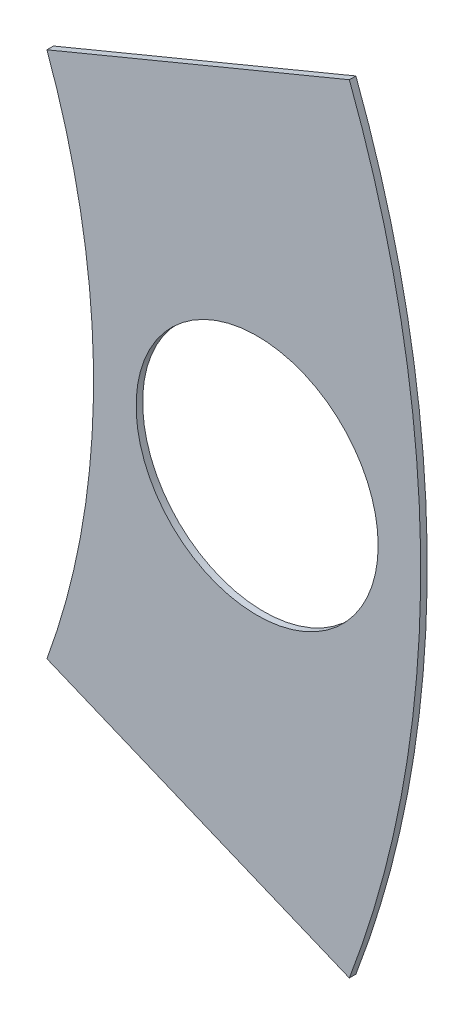
ISO-10303-21;
HEADER;
FILE_DESCRIPTION(('STEP AP214'),'2;1');
FILE_NAME('part.step','',(''),(''),'','','');
FILE_SCHEMA(('AUTOMOTIVE_DESIGN { 1 0 10303 214 1 1 1 1 }'));
ENDSEC;
DATA;
#1=APPLICATION_CONTEXT('core data for automotive mechanical design processes');
#2=APPLICATION_PROTOCOL_DEFINITION('international standard','automotive_design',2000,#1);
#3=PRODUCT_CONTEXT('',#1,'mechanical');
#4=PRODUCT('Part','Part','',(#3));
#5=PRODUCT_RELATED_PRODUCT_CATEGORY('part','',(#4));
#6=PRODUCT_DEFINITION_FORMATION('','',#4);
#7=PRODUCT_DEFINITION_CONTEXT('part definition',#1,'design');
#8=PRODUCT_DEFINITION('design','',#6,#7);
#9=PRODUCT_DEFINITION_SHAPE('','',#8);
#10=(LENGTH_UNIT() NAMED_UNIT(*) SI_UNIT(.MILLI.,.METRE.));
#11=(NAMED_UNIT(*) PLANE_ANGLE_UNIT() SI_UNIT($,.RADIAN.));
#12=(NAMED_UNIT(*) SI_UNIT($,.STERADIAN.) SOLID_ANGLE_UNIT());
#13=UNCERTAINTY_MEASURE_WITH_UNIT(LENGTH_MEASURE(1.E-05),#10,'distance_accuracy_value','');
#14=(GEOMETRIC_REPRESENTATION_CONTEXT(3) GLOBAL_UNCERTAINTY_ASSIGNED_CONTEXT((#13)) GLOBAL_UNIT_ASSIGNED_CONTEXT((#10,
#11,#12)) REPRESENTATION_CONTEXT('',''));
#15=CARTESIAN_POINT('',(0.,0.,0.));
#16=DIRECTION('',(0.,0.,1.));
#17=DIRECTION('',(1.,0.,0.));
#18=AXIS2_PLACEMENT_3D('',#15,#16,#17);
#19=CARTESIAN_POINT('',(0.,0.,0.254));
#20=DIRECTION('',(0.,0.,-1.));
#21=DIRECTION('',(-1.,0.,0.));
#22=AXIS2_PLACEMENT_3D('',#19,#20,#21);
#23=CYLINDRICAL_SURFACE('',#22,42.545);
#24=DIRECTION('',(0.,0.,1.));
#25=VECTOR('',#24,1.);
#26=CARTESIAN_POINT('',(39.7749464235118,15.1006841569105,0.));
#27=LINE('',#26,#25);
#28=CARTESIAN_POINT('',(39.7749464235118,15.1006841569105,0.));
#29=VERTEX_POINT('',#28);
#30=CARTESIAN_POINT('',(39.7749464235118,15.1006841569105,0.254));
#31=VERTEX_POINT('',#30);
#32=EDGE_CURVE('E102',#29,#31,#27,.T.);
#33=ORIENTED_EDGE('',*,*,#32,.T.);
#34=CARTESIAN_POINT('',(0.,0.,0.254));
#35=DIRECTION('',(0.,0.,1.));
#36=DIRECTION('',(1.,0.,0.));
#37=AXIS2_PLACEMENT_3D('',#34,#35,#36);
#38=CIRCLE('',#37,42.545);
#39=CARTESIAN_POINT('',(39.7749464235118,-15.1006841569105,0.254));
#40=VERTEX_POINT('',#39);
#41=EDGE_CURVE('E12',#40,#31,#38,.T.);
#42=ORIENTED_EDGE('',*,*,#41,.F.);
#43=DIRECTION('',(0.,0.,1.));
#44=VECTOR('',#43,1.);
#45=CARTESIAN_POINT('',(39.7749464235118,-15.1006841569105,0.));
#46=LINE('',#45,#44);
#47=CARTESIAN_POINT('',(39.7749464235118,-15.1006841569105,0.));
#48=VERTEX_POINT('',#47);
#49=EDGE_CURVE('E79',#48,#40,#46,.T.);
#50=ORIENTED_EDGE('',*,*,#49,.F.);
#51=CARTESIAN_POINT('',(0.,0.,0.));
#52=DIRECTION('',(0.,0.,1.));
#53=DIRECTION('',(1.,0.,0.));
#54=AXIS2_PLACEMENT_3D('',#51,#52,#53);
#55=CIRCLE('',#54,42.545);
#56=EDGE_CURVE('E36',#48,#29,#55,.T.);
#57=ORIENTED_EDGE('',*,*,#56,.T.);
#58=EDGE_LOOP('',(#33,#42,#50,#57));
#59=FACE_BOUND('',#58,.T.);
#60=ADVANCED_FACE('F33',(#59),#23,.T.);
#61=CARTESIAN_POINT('',(0.,0.,0.254));
#62=DIRECTION('',(0.,0.,1.));
#63=DIRECTION('',(1.,0.,0.));
#64=AXIS2_PLACEMENT_3D('',#61,#62,#63);
#65=PLANE('',#64);
#66=CARTESIAN_POINT('',(36.195,0.,0.254));
#67=DIRECTION('',(0.,0.,1.));
#68=DIRECTION('',(1.,0.,0.));
#69=AXIS2_PLACEMENT_3D('',#66,#67,#68);
#70=CIRCLE('',#69,4.699);
#71=CARTESIAN_POINT('',(40.894,0.,0.254));
#72=VERTEX_POINT('',#71);
#73=EDGE_CURVE('E96',#72,#72,#70,.T.);
#74=ORIENTED_EDGE('',*,*,#73,.F.);
#75=EDGE_LOOP('',(#74));
#76=FACE_BOUND('',#75,.T.);
#77=ORIENTED_EDGE('',*,*,#41,.T.);
#78=DIRECTION('',(-0.923879532511287,-0.38268343236509,0.));
#79=VECTOR('',#78,1.);
#80=CARTESIAN_POINT('',(28.034216891046,10.2375147524089,0.254));
#81=LINE('',#80,#79);
#82=CARTESIAN_POINT('',(28.034216891046,10.2375147524089,0.254));
#83=VERTEX_POINT('',#82);
#84=EDGE_CURVE('E87',#31,#83,#81,.T.);
#85=ORIENTED_EDGE('',*,*,#84,.T.);
#86=CARTESIAN_POINT('',(0.,0.,0.254));
#87=DIRECTION('',(0.,0.,1.));
#88=DIRECTION('',(1.,0.,0.));
#89=AXIS2_PLACEMENT_3D('',#86,#87,#88);
#90=CIRCLE('',#89,29.845);
#91=CARTESIAN_POINT('',(28.034216891046,-10.2375147524089,0.254));
#92=VERTEX_POINT('',#91);
#93=EDGE_CURVE('E91',#92,#83,#90,.T.);
#94=ORIENTED_EDGE('',*,*,#93,.F.);
#95=DIRECTION('',(0.923879532511286,-0.382683432365091,0.));
#96=VECTOR('',#95,1.);
#97=CARTESIAN_POINT('',(28.034216891046,-10.2375147524089,0.254));
#98=LINE('',#97,#96);
#99=EDGE_CURVE('E47',#92,#40,#98,.T.);
#100=ORIENTED_EDGE('',*,*,#99,.T.);
#101=EDGE_LOOP('',(#77,#85,#94,#100));
#102=FACE_BOUND('',#101,.T.);
#103=ADVANCED_FACE('F111',(#76,#102),#65,.T.);
#104=CARTESIAN_POINT('',(0.,0.,0.));
#105=DIRECTION('',(0.,0.,1.));
#106=DIRECTION('',(1.,0.,0.));
#107=AXIS2_PLACEMENT_3D('',#104,#105,#106);
#108=PLANE('',#107);
#109=CARTESIAN_POINT('',(36.195,0.,0.));
#110=DIRECTION('',(0.,0.,1.));
#111=DIRECTION('',(1.,0.,0.));
#112=AXIS2_PLACEMENT_3D('',#109,#110,#111);
#113=CIRCLE('',#112,4.699);
#114=CARTESIAN_POINT('',(40.894,0.,0.));
#115=VERTEX_POINT('',#114);
#116=EDGE_CURVE('E93',#115,#115,#113,.T.);
#117=ORIENTED_EDGE('',*,*,#116,.T.);
#118=EDGE_LOOP('',(#117));
#119=FACE_BOUND('',#118,.T.);
#120=DIRECTION('',(-0.923879532511287,-0.38268343236509,0.));
#121=VECTOR('',#120,1.);
#122=CARTESIAN_POINT('',(28.034216891046,10.2375147524089,0.));
#123=LINE('',#122,#121);
#124=CARTESIAN_POINT('',(28.034216891046,10.2375147524089,0.));
#125=VERTEX_POINT('',#124);
#126=EDGE_CURVE('E55',#29,#125,#123,.T.);
#127=ORIENTED_EDGE('',*,*,#126,.F.);
#128=ORIENTED_EDGE('',*,*,#56,.F.);
#129=DIRECTION('',(0.923879532511286,-0.382683432365091,0.));
#130=VECTOR('',#129,1.);
#131=CARTESIAN_POINT('',(28.034216891046,-10.2375147524089,0.));
#132=LINE('',#131,#130);
#133=CARTESIAN_POINT('',(28.034216891046,-10.2375147524089,0.));
#134=VERTEX_POINT('',#133);
#135=EDGE_CURVE('E73',#134,#48,#132,.T.);
#136=ORIENTED_EDGE('',*,*,#135,.F.);
#137=CARTESIAN_POINT('',(0.,0.,0.));
#138=DIRECTION('',(0.,0.,1.));
#139=DIRECTION('',(1.,0.,0.));
#140=AXIS2_PLACEMENT_3D('',#137,#138,#139);
#141=CIRCLE('',#140,29.845);
#142=EDGE_CURVE('E85',#134,#125,#141,.T.);
#143=ORIENTED_EDGE('',*,*,#142,.T.);
#144=EDGE_LOOP('',(#127,#128,#136,#143));
#145=FACE_BOUND('',#144,.T.);
#146=ADVANCED_FACE('F84',(#119,#145),#108,.F.);
#147=CARTESIAN_POINT('',(0.,0.,0.));
#148=DIRECTION('',(0.,0.,1.));
#149=DIRECTION('',(1.,0.,0.));
#150=AXIS2_PLACEMENT_3D('',#147,#148,#149);
#151=CYLINDRICAL_SURFACE('',#150,29.845);
#152=DIRECTION('',(0.,0.,1.));
#153=VECTOR('',#152,1.);
#154=CARTESIAN_POINT('',(28.034216891046,10.2375147524089,0.));
#155=LINE('',#154,#153);
#156=EDGE_CURVE('E90',#125,#83,#155,.T.);
#157=ORIENTED_EDGE('',*,*,#156,.F.);
#158=ORIENTED_EDGE('',*,*,#142,.F.);
#159=DIRECTION('',(0.,0.,1.));
#160=VECTOR('',#159,1.);
#161=CARTESIAN_POINT('',(28.034216891046,-10.2375147524089,0.));
#162=LINE('',#161,#160);
#163=EDGE_CURVE('E70',#134,#92,#162,.T.);
#164=ORIENTED_EDGE('',*,*,#163,.T.);
#165=ORIENTED_EDGE('',*,*,#93,.T.);
#166=EDGE_LOOP('',(#157,#158,#164,#165));
#167=FACE_BOUND('',#166,.T.);
#168=ADVANCED_FACE('F89',(#167),#151,.F.);
#169=CARTESIAN_POINT('',(36.195,0.,0.));
#170=DIRECTION('',(0.,0.,1.));
#171=DIRECTION('',(1.,0.,0.));
#172=AXIS2_PLACEMENT_3D('',#169,#170,#171);
#173=CYLINDRICAL_SURFACE('',#172,4.699);
#174=ORIENTED_EDGE('',*,*,#116,.F.);
#175=EDGE_LOOP('',(#174));
#176=FACE_BOUND('',#175,.T.);
#177=ORIENTED_EDGE('',*,*,#73,.T.);
#178=EDGE_LOOP('',(#177));
#179=FACE_BOUND('',#178,.T.);
#180=ADVANCED_FACE('F119',(#176,#179),#173,.F.);
#181=CARTESIAN_POINT('',(28.034216891046,-10.2375147524089,0.));
#182=DIRECTION('',(-0.382683432365091,-0.923879532511287,0.));
#183=DIRECTION('',(0.923879532511287,-0.382683432365091,0.));
#184=AXIS2_PLACEMENT_3D('',#181,#182,#183);
#185=PLANE('',#184);
#186=ORIENTED_EDGE('',*,*,#99,.F.);
#187=ORIENTED_EDGE('',*,*,#163,.F.);
#188=ORIENTED_EDGE('',*,*,#135,.T.);
#189=ORIENTED_EDGE('',*,*,#49,.T.);
#190=EDGE_LOOP('',(#186,#187,#188,#189));
#191=FACE_BOUND('',#190,.T.);
#192=ADVANCED_FACE('F72',(#191),#185,.T.);
#193=CARTESIAN_POINT('',(28.034216891046,10.2375147524089,0.));
#194=DIRECTION('',(-0.38268343236509,0.923879532511287,0.));
#195=DIRECTION('',(-0.923879532511287,-0.38268343236509,0.));
#196=AXIS2_PLACEMENT_3D('',#193,#194,#195);
#197=PLANE('',#196);
#198=ORIENTED_EDGE('',*,*,#84,.F.);
#199=ORIENTED_EDGE('',*,*,#32,.F.);
#200=ORIENTED_EDGE('',*,*,#126,.T.);
#201=ORIENTED_EDGE('',*,*,#156,.T.);
#202=EDGE_LOOP('',(#198,#199,#200,#201));
#203=FACE_BOUND('',#202,.T.);
#204=ADVANCED_FACE('F113',(#203),#197,.T.);
#205=CLOSED_SHELL('',(#60,#103,#146,#168,#180,#192,#204));
#206=MANIFOLD_SOLID_BREP('B2',#205);
#207=ADVANCED_BREP_SHAPE_REPRESENTATION('',(#18,#206),#14);
#208=SHAPE_DEFINITION_REPRESENTATION(#9,#207);
ENDSEC;
END-ISO-10303-21;
